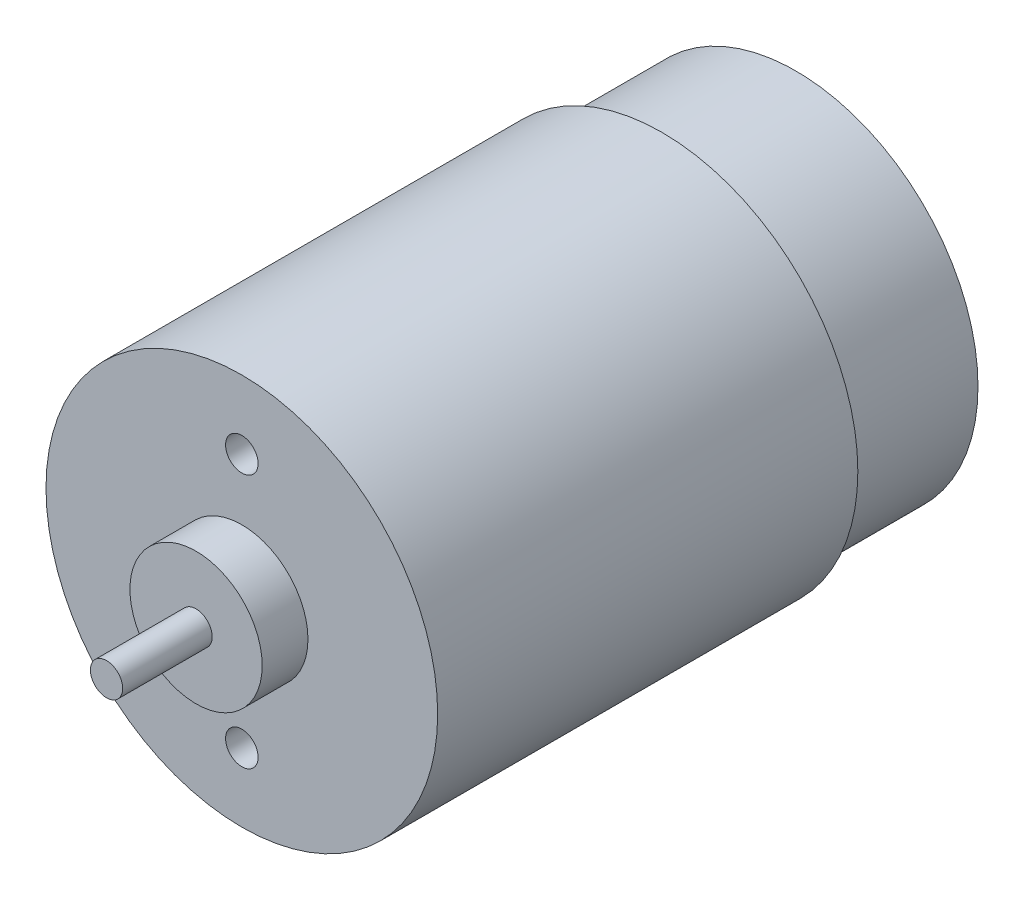
ISO-10303-21;
HEADER;
FILE_DESCRIPTION(('STEP AP214'),'2;1');
FILE_NAME('part.step','',(''),(''),'','','');
FILE_SCHEMA(('AUTOMOTIVE_DESIGN { 1 0 10303 214 1 1 1 1 }'));
ENDSEC;
DATA;
#1=APPLICATION_CONTEXT('core data for automotive mechanical design processes');
#2=APPLICATION_PROTOCOL_DEFINITION('international standard','automotive_design',2000,#1);
#3=PRODUCT_CONTEXT('',#1,'mechanical');
#4=PRODUCT('Part','Part','',(#3));
#5=PRODUCT_RELATED_PRODUCT_CATEGORY('part','',(#4));
#6=PRODUCT_DEFINITION_FORMATION('','',#4);
#7=PRODUCT_DEFINITION_CONTEXT('part definition',#1,'design');
#8=PRODUCT_DEFINITION('design','',#6,#7);
#9=PRODUCT_DEFINITION_SHAPE('','',#8);
#10=(LENGTH_UNIT() NAMED_UNIT(*) SI_UNIT(.MILLI.,.METRE.));
#11=(NAMED_UNIT(*) PLANE_ANGLE_UNIT() SI_UNIT($,.RADIAN.));
#12=(NAMED_UNIT(*) SI_UNIT($,.STERADIAN.) SOLID_ANGLE_UNIT());
#13=UNCERTAINTY_MEASURE_WITH_UNIT(LENGTH_MEASURE(1.E-05),#10,'distance_accuracy_value','');
#14=(GEOMETRIC_REPRESENTATION_CONTEXT(3) GLOBAL_UNCERTAINTY_ASSIGNED_CONTEXT((#13)) GLOBAL_UNIT_ASSIGNED_CONTEXT((#10,
#11,#12)) REPRESENTATION_CONTEXT('',''));
#15=CARTESIAN_POINT('',(0.,0.,0.));
#16=DIRECTION('',(0.,0.,1.));
#17=DIRECTION('',(1.,0.,0.));
#18=AXIS2_PLACEMENT_3D('',#15,#16,#17);
#19=CARTESIAN_POINT('',(0.,0.,41.3));
#20=DIRECTION('',(0.,0.,-1.));
#21=DIRECTION('',(-1.,0.,0.));
#22=AXIS2_PLACEMENT_3D('',#19,#20,#21);
#23=CYLINDRICAL_SURFACE('',#22,19.25);
#24=CARTESIAN_POINT('',(0.,0.,41.3));
#25=DIRECTION('',(0.,0.,1.));
#26=DIRECTION('',(1.,0.,0.));
#27=AXIS2_PLACEMENT_3D('',#24,#25,#26);
#28=CIRCLE('',#27,19.25);
#29=CARTESIAN_POINT('',(19.25,0.,41.3));
#30=VERTEX_POINT('',#29);
#31=EDGE_CURVE('E39',#30,#30,#28,.T.);
#32=ORIENTED_EDGE('',*,*,#31,.F.);
#33=EDGE_LOOP('',(#32));
#34=FACE_BOUND('',#33,.T.);
#35=CARTESIAN_POINT('',(0.,0.,0.));
#36=DIRECTION('',(0.,0.,1.));
#37=DIRECTION('',(1.,0.,0.));
#38=AXIS2_PLACEMENT_3D('',#35,#36,#37);
#39=CIRCLE('',#38,19.25);
#40=CARTESIAN_POINT('',(19.25,0.,0.));
#41=VERTEX_POINT('',#40);
#42=EDGE_CURVE('E43',#41,#41,#39,.T.);
#43=ORIENTED_EDGE('',*,*,#42,.T.);
#44=EDGE_LOOP('',(#43));
#45=FACE_BOUND('',#44,.T.);
#46=ADVANCED_FACE('F33',(#34,#45),#23,.T.);
#47=CARTESIAN_POINT('',(0.,0.,41.3));
#48=DIRECTION('',(0.,0.,1.));
#49=DIRECTION('',(1.,0.,0.));
#50=AXIS2_PLACEMENT_3D('',#47,#48,#49);
#51=PLANE('',#50);
#52=CARTESIAN_POINT('',(1.51143412198915E-12,-12.5,41.3));
#53=DIRECTION('',(0.,0.,1.));
#54=DIRECTION('',(1.,0.,0.));
#55=AXIS2_PLACEMENT_3D('',#52,#53,#54);
#56=CIRCLE('',#55,1.60000000000153);
#57=CARTESIAN_POINT('',(1.60000000000304,-12.5,41.3));
#58=VERTEX_POINT('',#57);
#59=EDGE_CURVE('E87',#58,#58,#56,.T.);
#60=ORIENTED_EDGE('',*,*,#59,.F.);
#61=EDGE_LOOP('',(#60));
#62=FACE_BOUND('',#61,.T.);
#63=CARTESIAN_POINT('',(0.,12.5,41.3));
#64=DIRECTION('',(0.,0.,1.));
#65=DIRECTION('',(1.,0.,0.));
#66=AXIS2_PLACEMENT_3D('',#63,#64,#65);
#67=CIRCLE('',#66,1.6);
#68=CARTESIAN_POINT('',(1.6,12.5,41.3));
#69=VERTEX_POINT('',#68);
#70=EDGE_CURVE('E81',#69,#69,#67,.T.);
#71=ORIENTED_EDGE('',*,*,#70,.F.);
#72=EDGE_LOOP('',(#71));
#73=FACE_BOUND('',#72,.T.);
#74=CARTESIAN_POINT('',(0.,0.,41.3));
#75=DIRECTION('',(0.,0.,1.));
#76=DIRECTION('',(1.,0.,0.));
#77=AXIS2_PLACEMENT_3D('',#74,#75,#76);
#78=CIRCLE('',#77,6.5);
#79=CARTESIAN_POINT('',(6.5,0.,41.3));
#80=VERTEX_POINT('',#79);
#81=EDGE_CURVE('E59',#80,#80,#78,.T.);
#82=ORIENTED_EDGE('',*,*,#81,.F.);
#83=EDGE_LOOP('',(#82));
#84=FACE_BOUND('',#83,.T.);
#85=ORIENTED_EDGE('',*,*,#31,.T.);
#86=EDGE_LOOP('',(#85));
#87=FACE_BOUND('',#86,.T.);
#88=ADVANCED_FACE('F102',(#62,#73,#84,#87),#51,.T.);
#89=CARTESIAN_POINT('',(0.,0.,0.));
#90=DIRECTION('',(0.,0.,1.));
#91=DIRECTION('',(1.,0.,0.));
#92=AXIS2_PLACEMENT_3D('',#89,#90,#91);
#93=PLANE('',#92);
#94=CARTESIAN_POINT('',(0.,0.,0.));
#95=DIRECTION('',(0.,0.,1.));
#96=DIRECTION('',(1.,0.,0.));
#97=AXIS2_PLACEMENT_3D('',#94,#95,#96);
#98=CIRCLE('',#97,17.9);
#99=CARTESIAN_POINT('',(17.9,0.,0.));
#100=VERTEX_POINT('',#99);
#101=EDGE_CURVE('E10',#100,#100,#98,.F.);
#102=ORIENTED_EDGE('',*,*,#101,.F.);
#103=EDGE_LOOP('',(#102));
#104=FACE_BOUND('',#103,.T.);
#105=ORIENTED_EDGE('',*,*,#42,.F.);
#106=EDGE_LOOP('',(#105));
#107=FACE_BOUND('',#106,.T.);
#108=ADVANCED_FACE('F105',(#104,#107),#93,.F.);
#109=CARTESIAN_POINT('',(0.,0.,45.8));
#110=DIRECTION('',(0.,0.,-1.));
#111=DIRECTION('',(-1.,0.,0.));
#112=AXIS2_PLACEMENT_3D('',#109,#110,#111);
#113=CYLINDRICAL_SURFACE('',#112,6.5);
#114=CARTESIAN_POINT('',(0.,0.,45.8));
#115=DIRECTION('',(0.,0.,1.));
#116=DIRECTION('',(1.,0.,0.));
#117=AXIS2_PLACEMENT_3D('',#114,#115,#116);
#118=CIRCLE('',#117,6.5);
#119=CARTESIAN_POINT('',(6.5,0.,45.8));
#120=VERTEX_POINT('',#119);
#121=EDGE_CURVE('E54',#120,#120,#118,.T.);
#122=ORIENTED_EDGE('',*,*,#121,.F.);
#123=EDGE_LOOP('',(#122));
#124=FACE_BOUND('',#123,.T.);
#125=ORIENTED_EDGE('',*,*,#81,.T.);
#126=EDGE_LOOP('',(#125));
#127=FACE_BOUND('',#126,.T.);
#128=ADVANCED_FACE('F111',(#124,#127),#113,.T.);
#129=CARTESIAN_POINT('',(0.,0.,45.8));
#130=DIRECTION('',(0.,0.,1.));
#131=DIRECTION('',(1.,0.,0.));
#132=AXIS2_PLACEMENT_3D('',#129,#130,#131);
#133=PLANE('',#132);
#134=CARTESIAN_POINT('',(0.,0.,45.8));
#135=DIRECTION('',(0.,0.,1.));
#136=DIRECTION('',(1.,0.,0.));
#137=AXIS2_PLACEMENT_3D('',#134,#135,#136);
#138=CIRCLE('',#137,1.585);
#139=CARTESIAN_POINT('',(1.585,0.,45.8));
#140=VERTEX_POINT('',#139);
#141=EDGE_CURVE('E52',#140,#140,#138,.T.);
#142=ORIENTED_EDGE('',*,*,#141,.F.);
#143=EDGE_LOOP('',(#142));
#144=FACE_BOUND('',#143,.T.);
#145=ORIENTED_EDGE('',*,*,#121,.T.);
#146=EDGE_LOOP('',(#145));
#147=FACE_BOUND('',#146,.T.);
#148=ADVANCED_FACE('F113',(#144,#147),#133,.T.);
#149=CARTESIAN_POINT('',(0.,0.,54.6));
#150=DIRECTION('',(0.,0.,1.));
#151=DIRECTION('',(1.,0.,0.));
#152=AXIS2_PLACEMENT_3D('',#149,#150,#151);
#153=PLANE('',#152);
#154=CARTESIAN_POINT('',(0.,0.,54.6));
#155=DIRECTION('',(0.,0.,1.));
#156=DIRECTION('',(1.,0.,0.));
#157=AXIS2_PLACEMENT_3D('',#154,#155,#156);
#158=CIRCLE('',#157,1.585);
#159=CARTESIAN_POINT('',(1.585,0.,54.6));
#160=VERTEX_POINT('',#159);
#161=EDGE_CURVE('E48',#160,#160,#158,.T.);
#162=ORIENTED_EDGE('',*,*,#161,.T.);
#163=EDGE_LOOP('',(#162));
#164=FACE_BOUND('',#163,.T.);
#165=ADVANCED_FACE('F120',(#164),#153,.T.);
#166=CARTESIAN_POINT('',(0.,0.,54.6));
#167=DIRECTION('',(0.,0.,-1.));
#168=DIRECTION('',(-1.,0.,0.));
#169=AXIS2_PLACEMENT_3D('',#166,#167,#168);
#170=CYLINDRICAL_SURFACE('',#169,1.585);
#171=ORIENTED_EDGE('',*,*,#141,.T.);
#172=EDGE_LOOP('',(#171));
#173=FACE_BOUND('',#172,.T.);
#174=ORIENTED_EDGE('',*,*,#161,.F.);
#175=EDGE_LOOP('',(#174));
#176=FACE_BOUND('',#175,.T.);
#177=ADVANCED_FACE('F150',(#173,#176),#170,.T.);
#178=CARTESIAN_POINT('',(0.,0.,-13.16));
#179=DIRECTION('',(0.,0.,1.));
#180=DIRECTION('',(1.,0.,0.));
#181=AXIS2_PLACEMENT_3D('',#178,#179,#180);
#182=CYLINDRICAL_SURFACE('',#181,17.9);
#183=CARTESIAN_POINT('',(0.,0.,-13.16));
#184=DIRECTION('',(0.,0.,-1.));
#185=DIRECTION('',(-1.,0.,0.));
#186=AXIS2_PLACEMENT_3D('',#183,#184,#185);
#187=CIRCLE('',#186,17.9);
#188=CARTESIAN_POINT('',(-17.9,0.,-13.16));
#189=VERTEX_POINT('',#188);
#190=EDGE_CURVE('E64',#189,#189,#187,.T.);
#191=ORIENTED_EDGE('',*,*,#190,.F.);
#192=EDGE_LOOP('',(#191));
#193=FACE_BOUND('',#192,.T.);
#194=ORIENTED_EDGE('',*,*,#101,.T.);
#195=EDGE_LOOP('',(#194));
#196=FACE_BOUND('',#195,.T.);
#197=ADVANCED_FACE('F154',(#193,#196),#182,.T.);
#198=CARTESIAN_POINT('',(0.,0.,-13.16));
#199=DIRECTION('',(0.,0.,-1.));
#200=DIRECTION('',(-1.,0.,0.));
#201=AXIS2_PLACEMENT_3D('',#198,#199,#200);
#202=PLANE('',#201);
#203=CARTESIAN_POINT('',(0.,0.,-13.16));
#204=DIRECTION('',(0.,0.,-1.));
#205=DIRECTION('',(-1.,0.,0.));
#206=AXIS2_PLACEMENT_3D('',#203,#204,#205);
#207=CIRCLE('',#206,5.1);
#208=CARTESIAN_POINT('',(-5.1,0.,-13.16));
#209=VERTEX_POINT('',#208);
#210=EDGE_CURVE('E69',#209,#209,#207,.T.);
#211=ORIENTED_EDGE('',*,*,#210,.F.);
#212=EDGE_LOOP('',(#211));
#213=FACE_BOUND('',#212,.T.);
#214=ORIENTED_EDGE('',*,*,#190,.T.);
#215=EDGE_LOOP('',(#214));
#216=FACE_BOUND('',#215,.T.);
#217=ADVANCED_FACE('F159',(#213,#216),#202,.T.);
#218=CARTESIAN_POINT('',(0.,0.,-16.16));
#219=DIRECTION('',(0.,0.,1.));
#220=DIRECTION('',(1.,0.,0.));
#221=AXIS2_PLACEMENT_3D('',#218,#219,#220);
#222=CYLINDRICAL_SURFACE('',#221,5.1);
#223=CARTESIAN_POINT('',(0.,0.,-16.16));
#224=DIRECTION('',(0.,0.,-1.));
#225=DIRECTION('',(-1.,0.,0.));
#226=AXIS2_PLACEMENT_3D('',#223,#224,#225);
#227=CIRCLE('',#226,5.1);
#228=CARTESIAN_POINT('',(-5.1,0.,-16.16));
#229=VERTEX_POINT('',#228);
#230=EDGE_CURVE('E68',#229,#229,#227,.T.);
#231=ORIENTED_EDGE('',*,*,#230,.F.);
#232=EDGE_LOOP('',(#231));
#233=FACE_BOUND('',#232,.T.);
#234=ORIENTED_EDGE('',*,*,#210,.T.);
#235=EDGE_LOOP('',(#234));
#236=FACE_BOUND('',#235,.T.);
#237=ADVANCED_FACE('F170',(#233,#236),#222,.T.);
#238=CARTESIAN_POINT('',(0.,0.,-16.16));
#239=DIRECTION('',(0.,0.,-1.));
#240=DIRECTION('',(-1.,0.,0.));
#241=AXIS2_PLACEMENT_3D('',#238,#239,#240);
#242=PLANE('',#241);
#243=CARTESIAN_POINT('',(0.,0.,-16.16));
#244=DIRECTION('',(0.,0.,-1.));
#245=DIRECTION('',(-1.,0.,0.));
#246=AXIS2_PLACEMENT_3D('',#243,#244,#245);
#247=CIRCLE('',#246,2.375);
#248=CARTESIAN_POINT('',(-2.375,0.,-16.16));
#249=VERTEX_POINT('',#248);
#250=EDGE_CURVE('E75',#249,#249,#247,.T.);
#251=ORIENTED_EDGE('',*,*,#250,.F.);
#252=EDGE_LOOP('',(#251));
#253=FACE_BOUND('',#252,.T.);
#254=ORIENTED_EDGE('',*,*,#230,.T.);
#255=EDGE_LOOP('',(#254));
#256=FACE_BOUND('',#255,.T.);
#257=ADVANCED_FACE('F180',(#253,#256),#242,.T.);
#258=CARTESIAN_POINT('',(0.,0.,-19.16));
#259=DIRECTION('',(0.,0.,1.));
#260=DIRECTION('',(1.,0.,0.));
#261=AXIS2_PLACEMENT_3D('',#258,#259,#260);
#262=CYLINDRICAL_SURFACE('',#261,2.375);
#263=CARTESIAN_POINT('',(0.,0.,-19.16));
#264=DIRECTION('',(0.,0.,-1.));
#265=DIRECTION('',(-1.,0.,0.));
#266=AXIS2_PLACEMENT_3D('',#263,#264,#265);
#267=CIRCLE('',#266,2.375);
#268=CARTESIAN_POINT('',(-2.375,0.,-19.16));
#269=VERTEX_POINT('',#268);
#270=EDGE_CURVE('E72',#269,#269,#267,.T.);
#271=ORIENTED_EDGE('',*,*,#270,.F.);
#272=EDGE_LOOP('',(#271));
#273=FACE_BOUND('',#272,.T.);
#274=ORIENTED_EDGE('',*,*,#250,.T.);
#275=EDGE_LOOP('',(#274));
#276=FACE_BOUND('',#275,.T.);
#277=ADVANCED_FACE('F190',(#273,#276),#262,.T.);
#278=CARTESIAN_POINT('',(0.,0.,-19.16));
#279=DIRECTION('',(0.,0.,-1.));
#280=DIRECTION('',(-1.,0.,0.));
#281=AXIS2_PLACEMENT_3D('',#278,#279,#280);
#282=PLANE('',#281);
#283=ORIENTED_EDGE('',*,*,#270,.T.);
#284=EDGE_LOOP('',(#283));
#285=FACE_BOUND('',#284,.T.);
#286=ADVANCED_FACE('F199',(#285),#282,.T.);
#287=CARTESIAN_POINT('',(0.,12.5,38.300006));
#288=DIRECTION('',(0.,0.,1.));
#289=DIRECTION('',(1.,0.,0.));
#290=AXIS2_PLACEMENT_3D('',#287,#288,#289);
#291=CYLINDRICAL_SURFACE('',#290,1.6);
#292=CARTESIAN_POINT('',(0.,12.5,38.300006));
#293=DIRECTION('',(0.,0.,1.));
#294=DIRECTION('',(1.,0.,0.));
#295=AXIS2_PLACEMENT_3D('',#292,#293,#294);
#296=CIRCLE('',#295,1.6);
#297=CARTESIAN_POINT('',(1.6,12.5,38.300006));
#298=VERTEX_POINT('',#297);
#299=EDGE_CURVE('E78',#298,#298,#296,.T.);
#300=ORIENTED_EDGE('',*,*,#299,.F.);
#301=EDGE_LOOP('',(#300));
#302=FACE_BOUND('',#301,.T.);
#303=ORIENTED_EDGE('',*,*,#70,.T.);
#304=EDGE_LOOP('',(#303));
#305=FACE_BOUND('',#304,.T.);
#306=ADVANCED_FACE('F208',(#302,#305),#291,.F.);
#307=CARTESIAN_POINT('',(0.,12.5,38.300006));
#308=DIRECTION('',(0.,0.,1.));
#309=DIRECTION('',(1.,0.,0.));
#310=AXIS2_PLACEMENT_3D('',#307,#308,#309);
#311=PLANE('',#310);
#312=ORIENTED_EDGE('',*,*,#299,.T.);
#313=EDGE_LOOP('',(#312));
#314=FACE_BOUND('',#313,.T.);
#315=ADVANCED_FACE('F98',(#314),#311,.T.);
#316=CARTESIAN_POINT('',(1.51143412198915E-12,-12.5,38.300006));
#317=DIRECTION('',(0.,0.,1.));
#318=DIRECTION('',(1.,0.,0.));
#319=AXIS2_PLACEMENT_3D('',#316,#317,#318);
#320=CYLINDRICAL_SURFACE('',#319,1.60000000000153);
#321=CARTESIAN_POINT('',(1.51143412198915E-12,-12.5,38.300006));
#322=DIRECTION('',(0.,0.,1.));
#323=DIRECTION('',(1.,0.,0.));
#324=AXIS2_PLACEMENT_3D('',#321,#322,#323);
#325=CIRCLE('',#324,1.60000000000153);
#326=CARTESIAN_POINT('',(1.60000000000304,-12.5,38.300006));
#327=VERTEX_POINT('',#326);
#328=EDGE_CURVE('E84',#327,#327,#325,.T.);
#329=ORIENTED_EDGE('',*,*,#328,.F.);
#330=EDGE_LOOP('',(#329));
#331=FACE_BOUND('',#330,.T.);
#332=ORIENTED_EDGE('',*,*,#59,.T.);
#333=EDGE_LOOP('',(#332));
#334=FACE_BOUND('',#333,.T.);
#335=ADVANCED_FACE('F95',(#331,#334),#320,.F.);
#336=CARTESIAN_POINT('',(1.51143412198915E-12,-12.5,38.300006));
#337=DIRECTION('',(0.,0.,1.));
#338=DIRECTION('',(1.,0.,0.));
#339=AXIS2_PLACEMENT_3D('',#336,#337,#338);
#340=PLANE('',#339);
#341=ORIENTED_EDGE('',*,*,#328,.T.);
#342=EDGE_LOOP('',(#341));
#343=FACE_BOUND('',#342,.T.);
#344=ADVANCED_FACE('F93',(#343),#340,.T.);
#345=CLOSED_SHELL('',(#46,#88,#108,#128,#148,#165,#177,#197,#217,#237,#257,#277,#286,#306,#315,
#335,#344));
#346=MANIFOLD_SOLID_BREP('B2',#345);
#347=ADVANCED_BREP_SHAPE_REPRESENTATION('',(#18,#346),#14);
#348=SHAPE_DEFINITION_REPRESENTATION(#9,#347);
ENDSEC;
END-ISO-10303-21;
